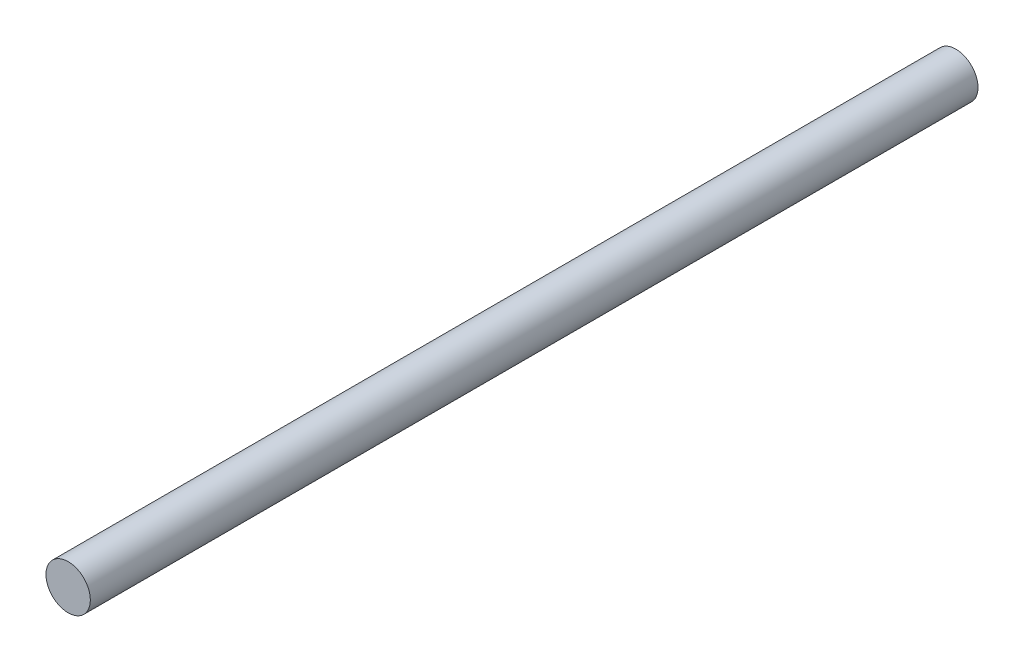
ISO-10303-21;
HEADER;
FILE_DESCRIPTION(('STEP AP214'),'2;1');
FILE_NAME('part.step','',(''),(''),'','','');
FILE_SCHEMA(('AUTOMOTIVE_DESIGN { 1 0 10303 214 1 1 1 1 }'));
ENDSEC;
DATA;
#1=APPLICATION_CONTEXT('core data for automotive mechanical design processes');
#2=APPLICATION_PROTOCOL_DEFINITION('international standard','automotive_design',2000,#1);
#3=PRODUCT_CONTEXT('',#1,'mechanical');
#4=PRODUCT('Part','Part','',(#3));
#5=PRODUCT_RELATED_PRODUCT_CATEGORY('part','',(#4));
#6=PRODUCT_DEFINITION_FORMATION('','',#4);
#7=PRODUCT_DEFINITION_CONTEXT('part definition',#1,'design');
#8=PRODUCT_DEFINITION('design','',#6,#7);
#9=PRODUCT_DEFINITION_SHAPE('','',#8);
#10=(LENGTH_UNIT() NAMED_UNIT(*) SI_UNIT(.MILLI.,.METRE.));
#11=(NAMED_UNIT(*) PLANE_ANGLE_UNIT() SI_UNIT($,.RADIAN.));
#12=(NAMED_UNIT(*) SI_UNIT($,.STERADIAN.) SOLID_ANGLE_UNIT());
#13=UNCERTAINTY_MEASURE_WITH_UNIT(LENGTH_MEASURE(1.E-05),#10,'distance_accuracy_value','');
#14=(GEOMETRIC_REPRESENTATION_CONTEXT(3) GLOBAL_UNCERTAINTY_ASSIGNED_CONTEXT((#13)) GLOBAL_UNIT_ASSIGNED_CONTEXT((#10,
#11,#12)) REPRESENTATION_CONTEXT('',''));
#15=CARTESIAN_POINT('',(0.,0.,0.));
#16=DIRECTION('',(0.,0.,1.));
#17=DIRECTION('',(1.,0.,0.));
#18=AXIS2_PLACEMENT_3D('',#15,#16,#17);
#19=CARTESIAN_POINT('',(0.,0.,10.));
#20=DIRECTION('',(0.,0.,-1.));
#21=DIRECTION('',(-1.,0.,0.));
#22=AXIS2_PLACEMENT_3D('',#19,#20,#21);
#23=CYLINDRICAL_SURFACE('',#22,0.25);
#24=CARTESIAN_POINT('',(0.,0.,10.));
#25=DIRECTION('',(0.,0.,1.));
#26=DIRECTION('',(1.,0.,0.));
#27=AXIS2_PLACEMENT_3D('',#24,#25,#26);
#28=CIRCLE('',#27,0.25);
#29=CARTESIAN_POINT('',(0.25,0.,10.));
#30=VERTEX_POINT('',#29);
#31=EDGE_CURVE('E10',#30,#30,#28,.T.);
#32=ORIENTED_EDGE('',*,*,#31,.F.);
#33=EDGE_LOOP('',(#32));
#34=FACE_BOUND('',#33,.T.);
#35=CARTESIAN_POINT('',(0.,0.,0.));
#36=DIRECTION('',(0.,0.,1.));
#37=DIRECTION('',(1.,0.,0.));
#38=AXIS2_PLACEMENT_3D('',#35,#36,#37);
#39=CIRCLE('',#38,0.25);
#40=CARTESIAN_POINT('',(0.25,0.,0.));
#41=VERTEX_POINT('',#40);
#42=EDGE_CURVE('E38',#41,#41,#39,.T.);
#43=ORIENTED_EDGE('',*,*,#42,.T.);
#44=EDGE_LOOP('',(#43));
#45=FACE_BOUND('',#44,.T.);
#46=ADVANCED_FACE('F35',(#34,#45),#23,.T.);
#47=CARTESIAN_POINT('',(0.,0.,10.));
#48=DIRECTION('',(0.,0.,1.));
#49=DIRECTION('',(1.,0.,0.));
#50=AXIS2_PLACEMENT_3D('',#47,#48,#49);
#51=PLANE('',#50);
#52=ORIENTED_EDGE('',*,*,#31,.T.);
#53=EDGE_LOOP('',(#52));
#54=FACE_BOUND('',#53,.T.);
#55=ADVANCED_FACE('F50',(#54),#51,.T.);
#56=CARTESIAN_POINT('',(0.,0.,0.));
#57=DIRECTION('',(0.,0.,1.));
#58=DIRECTION('',(1.,0.,0.));
#59=AXIS2_PLACEMENT_3D('',#56,#57,#58);
#60=PLANE('',#59);
#61=ORIENTED_EDGE('',*,*,#42,.F.);
#62=EDGE_LOOP('',(#61));
#63=FACE_BOUND('',#62,.T.);
#64=ADVANCED_FACE('F48',(#63),#60,.F.);
#65=CLOSED_SHELL('',(#46,#55,#64));
#66=MANIFOLD_SOLID_BREP('B2',#65);
#67=ADVANCED_BREP_SHAPE_REPRESENTATION('',(#18,#66),#14);
#68=SHAPE_DEFINITION_REPRESENTATION(#9,#67);
ENDSEC;
END-ISO-10303-21;
